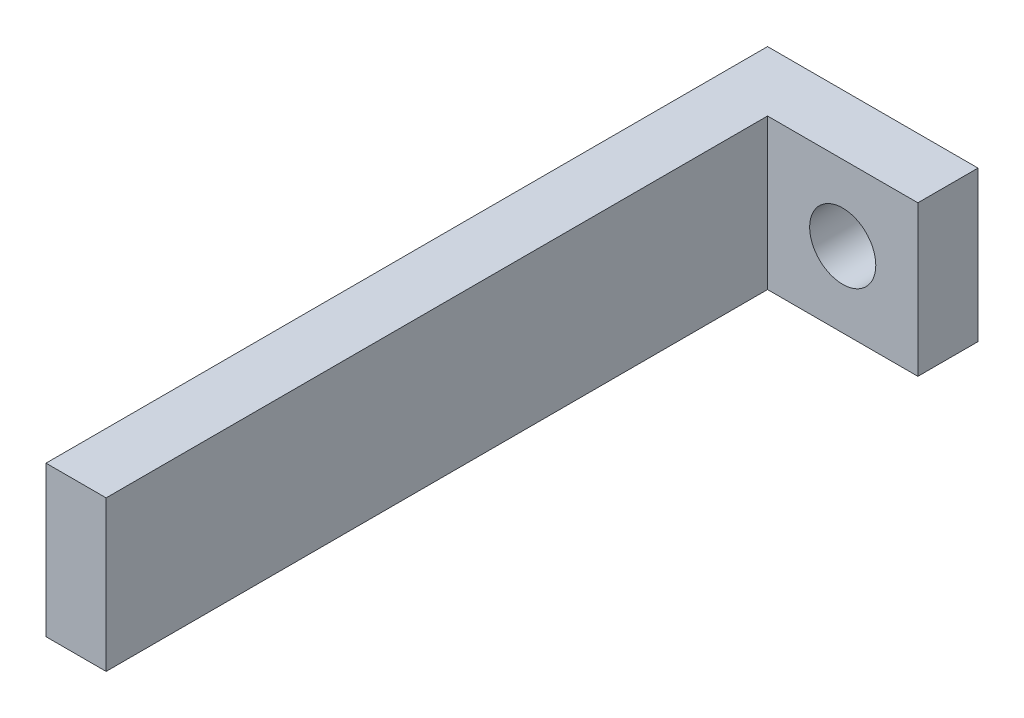
ISO-10303-21;
HEADER;
FILE_DESCRIPTION(('STEP AP214'),'2;1');
FILE_NAME('part.step','',(''),(''),'','','');
FILE_SCHEMA(('AUTOMOTIVE_DESIGN { 1 0 10303 214 1 1 1 1 }'));
ENDSEC;
DATA;
#1=APPLICATION_CONTEXT('core data for automotive mechanical design processes');
#2=APPLICATION_PROTOCOL_DEFINITION('international standard','automotive_design',2000,#1);
#3=PRODUCT_CONTEXT('',#1,'mechanical');
#4=PRODUCT('Part','Part','',(#3));
#5=PRODUCT_RELATED_PRODUCT_CATEGORY('part','',(#4));
#6=PRODUCT_DEFINITION_FORMATION('','',#4);
#7=PRODUCT_DEFINITION_CONTEXT('part definition',#1,'design');
#8=PRODUCT_DEFINITION('design','',#6,#7);
#9=PRODUCT_DEFINITION_SHAPE('','',#8);
#10=(LENGTH_UNIT() NAMED_UNIT(*) SI_UNIT(.MILLI.,.METRE.));
#11=(NAMED_UNIT(*) PLANE_ANGLE_UNIT() SI_UNIT($,.RADIAN.));
#12=(NAMED_UNIT(*) SI_UNIT($,.STERADIAN.) SOLID_ANGLE_UNIT());
#13=UNCERTAINTY_MEASURE_WITH_UNIT(LENGTH_MEASURE(1.E-05),#10,'distance_accuracy_value','');
#14=(GEOMETRIC_REPRESENTATION_CONTEXT(3) GLOBAL_UNCERTAINTY_ASSIGNED_CONTEXT((#13)) GLOBAL_UNIT_ASSIGNED_CONTEXT((#10,
#11,#12)) REPRESENTATION_CONTEXT('',''));
#15=CARTESIAN_POINT('',(0.,0.,0.));
#16=DIRECTION('',(0.,0.,1.));
#17=DIRECTION('',(1.,0.,0.));
#18=AXIS2_PLACEMENT_3D('',#15,#16,#17);
#19=CARTESIAN_POINT('',(-13.8056118609134,35.4192730900318,10.));
#20=DIRECTION('',(-1.,0.,0.));
#21=DIRECTION('',(0.,-1.,0.));
#22=AXIS2_PLACEMENT_3D('',#19,#20,#21);
#23=PLANE('',#22);
#24=DIRECTION('',(0.,1.,0.));
#25=VECTOR('',#24,1.);
#26=CARTESIAN_POINT('',(-13.8056118609134,35.4192730900318,0.));
#27=LINE('',#26,#25);
#28=CARTESIAN_POINT('',(-13.8056118609134,10.4192730900318,0.));
#29=VERTEX_POINT('',#28);
#30=CARTESIAN_POINT('',(-13.8056118609134,35.4192730900318,0.));
#31=VERTEX_POINT('',#30);
#32=EDGE_CURVE('E95',#29,#31,#27,.T.);
#33=ORIENTED_EDGE('',*,*,#32,.T.);
#34=DIRECTION('',(0.,0.,-1.));
#35=VECTOR('',#34,1.);
#36=CARTESIAN_POINT('',(-13.8056118609134,35.4192730900318,10.));
#37=LINE('',#36,#35);
#38=CARTESIAN_POINT('',(-13.8056118609134,35.4192730900318,10.));
#39=VERTEX_POINT('',#38);
#40=EDGE_CURVE('E11',#39,#31,#37,.T.);
#41=ORIENTED_EDGE('',*,*,#40,.F.);
#42=DIRECTION('',(0.,1.,0.));
#43=VECTOR('',#42,1.);
#44=CARTESIAN_POINT('',(-13.8056118609134,35.4192730900318,10.));
#45=LINE('',#44,#43);
#46=CARTESIAN_POINT('',(-13.8056118609134,10.4192730900318,10.));
#47=VERTEX_POINT('',#46);
#48=EDGE_CURVE('E87',#47,#39,#45,.T.);
#49=ORIENTED_EDGE('',*,*,#48,.F.);
#50=DIRECTION('',(0.,0.,-1.));
#51=VECTOR('',#50,1.);
#52=CARTESIAN_POINT('',(-13.8056118609134,10.4192730900318,10.));
#53=LINE('',#52,#51);
#54=EDGE_CURVE('E42',#47,#29,#53,.T.);
#55=ORIENTED_EDGE('',*,*,#54,.T.);
#56=EDGE_LOOP('',(#33,#41,#49,#55));
#57=FACE_BOUND('',#56,.T.);
#58=ADVANCED_FACE('F34',(#57),#23,.F.);
#59=CARTESIAN_POINT('',(-38.8056118609134,35.4192730900318,10.));
#60=DIRECTION('',(0.,-1.,0.));
#61=DIRECTION('',(0.,0.,-1.));
#62=AXIS2_PLACEMENT_3D('',#59,#60,#61);
#63=PLANE('',#62);
#64=DIRECTION('',(-1.,0.,0.));
#65=VECTOR('',#64,1.);
#66=CARTESIAN_POINT('',(-38.8056118609134,35.4192730900318,0.));
#67=LINE('',#66,#65);
#68=CARTESIAN_POINT('',(-48.8056118609134,35.4192730900318,0.));
#69=VERTEX_POINT('',#68);
#70=EDGE_CURVE('E63',#31,#69,#67,.T.);
#71=ORIENTED_EDGE('',*,*,#70,.T.);
#72=DIRECTION('',(0.,0.,-1.));
#73=VECTOR('',#72,1.);
#74=CARTESIAN_POINT('',(-48.8056118609134,35.4192730900318,120.));
#75=LINE('',#74,#73);
#76=CARTESIAN_POINT('',(-48.8056118609134,35.4192730900318,120.));
#77=VERTEX_POINT('',#76);
#78=EDGE_CURVE('E97',#77,#69,#75,.T.);
#79=ORIENTED_EDGE('',*,*,#78,.F.);
#80=DIRECTION('',(1.,0.,0.));
#81=VECTOR('',#80,1.);
#82=CARTESIAN_POINT('',(-38.8056118609134,35.4192730900318,120.));
#83=LINE('',#82,#81);
#84=CARTESIAN_POINT('',(-38.8056118609134,35.4192730900318,120.));
#85=VERTEX_POINT('',#84);
#86=EDGE_CURVE('E115',#77,#85,#83,.T.);
#87=ORIENTED_EDGE('',*,*,#86,.T.);
#88=DIRECTION('',(0.,0.,-1.));
#89=VECTOR('',#88,1.);
#90=CARTESIAN_POINT('',(-38.8056118609134,35.4192730900318,120.));
#91=LINE('',#90,#89);
#92=CARTESIAN_POINT('',(-38.8056118609134,35.4192730900318,9.99999999999999));
#93=VERTEX_POINT('',#92);
#94=EDGE_CURVE('E86',#85,#93,#91,.T.);
#95=ORIENTED_EDGE('',*,*,#94,.T.);
#96=DIRECTION('',(-1.,0.,0.));
#97=VECTOR('',#96,1.);
#98=CARTESIAN_POINT('',(-38.8056118609134,35.4192730900318,10.));
#99=LINE('',#98,#97);
#100=EDGE_CURVE('E81',#39,#93,#99,.T.);
#101=ORIENTED_EDGE('',*,*,#100,.F.);
#102=ORIENTED_EDGE('',*,*,#40,.T.);
#103=EDGE_LOOP('',(#71,#79,#87,#95,#101,#102));
#104=FACE_BOUND('',#103,.T.);
#105=ADVANCED_FACE('F82',(#104),#63,.F.);
#106=CARTESIAN_POINT('',(-38.8056118609134,10.4192730900318,10.));
#107=DIRECTION('',(0.,1.,0.));
#108=DIRECTION('',(0.,0.,1.));
#109=AXIS2_PLACEMENT_3D('',#106,#107,#108);
#110=PLANE('',#109);
#111=DIRECTION('',(1.,0.,0.));
#112=VECTOR('',#111,1.);
#113=CARTESIAN_POINT('',(-38.8056118609134,10.4192730900318,0.));
#114=LINE('',#113,#112);
#115=CARTESIAN_POINT('',(-48.8056118609134,10.4192730900318,0.));
#116=VERTEX_POINT('',#115);
#117=EDGE_CURVE('E93',#116,#29,#114,.T.);
#118=ORIENTED_EDGE('',*,*,#117,.T.);
#119=ORIENTED_EDGE('',*,*,#54,.F.);
#120=DIRECTION('',(1.,0.,0.));
#121=VECTOR('',#120,1.);
#122=CARTESIAN_POINT('',(-38.8056118609134,10.4192730900318,10.));
#123=LINE('',#122,#121);
#124=CARTESIAN_POINT('',(-38.8056118609134,10.4192730900318,10.));
#125=VERTEX_POINT('',#124);
#126=EDGE_CURVE('E50',#125,#47,#123,.T.);
#127=ORIENTED_EDGE('',*,*,#126,.F.);
#128=DIRECTION('',(0.,0.,-1.));
#129=VECTOR('',#128,1.);
#130=CARTESIAN_POINT('',(-38.8056118609134,10.4192730900318,120.));
#131=LINE('',#130,#129);
#132=CARTESIAN_POINT('',(-38.8056118609134,10.4192730900318,120.));
#133=VERTEX_POINT('',#132);
#134=EDGE_CURVE('E108',#133,#125,#131,.T.);
#135=ORIENTED_EDGE('',*,*,#134,.F.);
#136=DIRECTION('',(-1.,0.,0.));
#137=VECTOR('',#136,1.);
#138=CARTESIAN_POINT('',(-38.8056118609134,10.4192730900318,120.));
#139=LINE('',#138,#137);
#140=CARTESIAN_POINT('',(-48.8056118609134,10.4192730900318,120.));
#141=VERTEX_POINT('',#140);
#142=EDGE_CURVE('E119',#133,#141,#139,.T.);
#143=ORIENTED_EDGE('',*,*,#142,.T.);
#144=DIRECTION('',(0.,0.,-1.));
#145=VECTOR('',#144,1.);
#146=CARTESIAN_POINT('',(-48.8056118609134,10.4192730900318,120.));
#147=LINE('',#146,#145);
#148=EDGE_CURVE('E101',#141,#116,#147,.T.);
#149=ORIENTED_EDGE('',*,*,#148,.T.);
#150=EDGE_LOOP('',(#118,#119,#127,#135,#143,#149));
#151=FACE_BOUND('',#150,.T.);
#152=ADVANCED_FACE('F144',(#151),#110,.F.);
#153=CARTESIAN_POINT('',(0.,0.,10.));
#154=DIRECTION('',(0.,0.,1.));
#155=DIRECTION('',(1.,0.,0.));
#156=AXIS2_PLACEMENT_3D('',#153,#154,#155);
#157=PLANE('',#156);
#158=CARTESIAN_POINT('',(-26.3056118609134,22.9192730900318,9.99999999999999));
#159=DIRECTION('',(0.,0.,1.));
#160=DIRECTION('',(1.,0.,0.));
#161=AXIS2_PLACEMENT_3D('',#158,#159,#160);
#162=CIRCLE('',#161,5.5);
#163=CARTESIAN_POINT('',(-20.8056118609134,22.9192730900318,9.99999999999999));
#164=VERTEX_POINT('',#163);
#165=EDGE_CURVE('E116',#164,#164,#162,.T.);
#166=ORIENTED_EDGE('',*,*,#165,.F.);
#167=EDGE_LOOP('',(#166));
#168=FACE_BOUND('',#167,.T.);
#169=ORIENTED_EDGE('',*,*,#48,.T.);
#170=ORIENTED_EDGE('',*,*,#100,.T.);
#171=DIRECTION('',(0.,-1.,0.));
#172=VECTOR('',#171,1.);
#173=CARTESIAN_POINT('',(-38.8056118609134,35.4192730900318,10.));
#174=LINE('',#173,#172);
#175=EDGE_CURVE('E70',#93,#125,#174,.T.);
#176=ORIENTED_EDGE('',*,*,#175,.T.);
#177=ORIENTED_EDGE('',*,*,#126,.T.);
#178=EDGE_LOOP('',(#169,#170,#176,#177));
#179=FACE_BOUND('',#178,.T.);
#180=ADVANCED_FACE('F90',(#168,#179),#157,.T.);
#181=CARTESIAN_POINT('',(0.,0.,0.));
#182=DIRECTION('',(0.,0.,1.));
#183=DIRECTION('',(1.,0.,0.));
#184=AXIS2_PLACEMENT_3D('',#181,#182,#183);
#185=PLANE('',#184);
#186=CARTESIAN_POINT('',(-26.3056118609134,22.9192730900318,0.));
#187=DIRECTION('',(0.,0.,-1.));
#188=DIRECTION('',(-1.,0.,0.));
#189=AXIS2_PLACEMENT_3D('',#186,#187,#188);
#190=CIRCLE('',#189,5.5);
#191=CARTESIAN_POINT('',(-31.8056118609134,22.9192730900318,0.));
#192=VERTEX_POINT('',#191);
#193=EDGE_CURVE('E128',#192,#192,#190,.T.);
#194=ORIENTED_EDGE('',*,*,#193,.F.);
#195=EDGE_LOOP('',(#194));
#196=FACE_BOUND('',#195,.T.);
#197=ORIENTED_EDGE('',*,*,#32,.F.);
#198=ORIENTED_EDGE('',*,*,#117,.F.);
#199=DIRECTION('',(0.,1.,0.));
#200=VECTOR('',#199,1.);
#201=CARTESIAN_POINT('',(-48.8056118609134,35.4192730900318,0.));
#202=LINE('',#201,#200);
#203=EDGE_CURVE('E113',#116,#69,#202,.T.);
#204=ORIENTED_EDGE('',*,*,#203,.T.);
#205=ORIENTED_EDGE('',*,*,#70,.F.);
#206=EDGE_LOOP('',(#197,#198,#204,#205));
#207=FACE_BOUND('',#206,.T.);
#208=ADVANCED_FACE('F134',(#196,#207),#185,.F.);
#209=CARTESIAN_POINT('',(-38.8056118609134,35.4192730900318,120.));
#210=DIRECTION('',(1.,0.,0.));
#211=DIRECTION('',(0.,1.,0.));
#212=AXIS2_PLACEMENT_3D('',#209,#210,#211);
#213=PLANE('',#212);
#214=ORIENTED_EDGE('',*,*,#175,.F.);
#215=ORIENTED_EDGE('',*,*,#94,.F.);
#216=DIRECTION('',(0.,-1.,0.));
#217=VECTOR('',#216,1.);
#218=CARTESIAN_POINT('',(-38.8056118609134,35.4192730900318,120.));
#219=LINE('',#218,#217);
#220=EDGE_CURVE('E122',#85,#133,#219,.T.);
#221=ORIENTED_EDGE('',*,*,#220,.T.);
#222=ORIENTED_EDGE('',*,*,#134,.T.);
#223=EDGE_LOOP('',(#214,#215,#221,#222));
#224=FACE_BOUND('',#223,.T.);
#225=ADVANCED_FACE('F136',(#224),#213,.T.);
#226=CARTESIAN_POINT('',(-48.8056118609134,35.4192730900318,120.));
#227=DIRECTION('',(-1.,0.,0.));
#228=DIRECTION('',(0.,-1.,0.));
#229=AXIS2_PLACEMENT_3D('',#226,#227,#228);
#230=PLANE('',#229);
#231=ORIENTED_EDGE('',*,*,#203,.F.);
#232=ORIENTED_EDGE('',*,*,#148,.F.);
#233=DIRECTION('',(0.,1.,0.));
#234=VECTOR('',#233,1.);
#235=CARTESIAN_POINT('',(-48.8056118609134,35.4192730900318,120.));
#236=LINE('',#235,#234);
#237=EDGE_CURVE('E109',#141,#77,#236,.T.);
#238=ORIENTED_EDGE('',*,*,#237,.T.);
#239=ORIENTED_EDGE('',*,*,#78,.T.);
#240=EDGE_LOOP('',(#231,#232,#238,#239));
#241=FACE_BOUND('',#240,.T.);
#242=ADVANCED_FACE('F142',(#241),#230,.T.);
#243=CARTESIAN_POINT('',(0.,0.,120.));
#244=DIRECTION('',(0.,0.,1.));
#245=DIRECTION('',(1.,0.,0.));
#246=AXIS2_PLACEMENT_3D('',#243,#244,#245);
#247=PLANE('',#246);
#248=ORIENTED_EDGE('',*,*,#86,.F.);
#249=ORIENTED_EDGE('',*,*,#237,.F.);
#250=ORIENTED_EDGE('',*,*,#142,.F.);
#251=ORIENTED_EDGE('',*,*,#220,.F.);
#252=EDGE_LOOP('',(#248,#249,#250,#251));
#253=FACE_BOUND('',#252,.T.);
#254=ADVANCED_FACE('F171',(#253),#247,.T.);
#255=CARTESIAN_POINT('',(-26.3056118609134,22.9192730900318,120.));
#256=DIRECTION('',(0.,0.,-1.));
#257=DIRECTION('',(-1.,0.,0.));
#258=AXIS2_PLACEMENT_3D('',#255,#256,#257);
#259=CYLINDRICAL_SURFACE('',#258,5.5);
#260=ORIENTED_EDGE('',*,*,#165,.T.);
#261=EDGE_LOOP('',(#260));
#262=FACE_BOUND('',#261,.T.);
#263=ORIENTED_EDGE('',*,*,#193,.T.);
#264=EDGE_LOOP('',(#263));
#265=FACE_BOUND('',#264,.T.);
#266=ADVANCED_FACE('F132',(#262,#265),#259,.F.);
#267=CLOSED_SHELL('',(#58,#105,#152,#180,#208,#225,#242,#254,#266));
#268=MANIFOLD_SOLID_BREP('B2',#267);
#269=ADVANCED_BREP_SHAPE_REPRESENTATION('',(#18,#268),#14);
#270=SHAPE_DEFINITION_REPRESENTATION(#9,#269);
ENDSEC;
END-ISO-10303-21;
